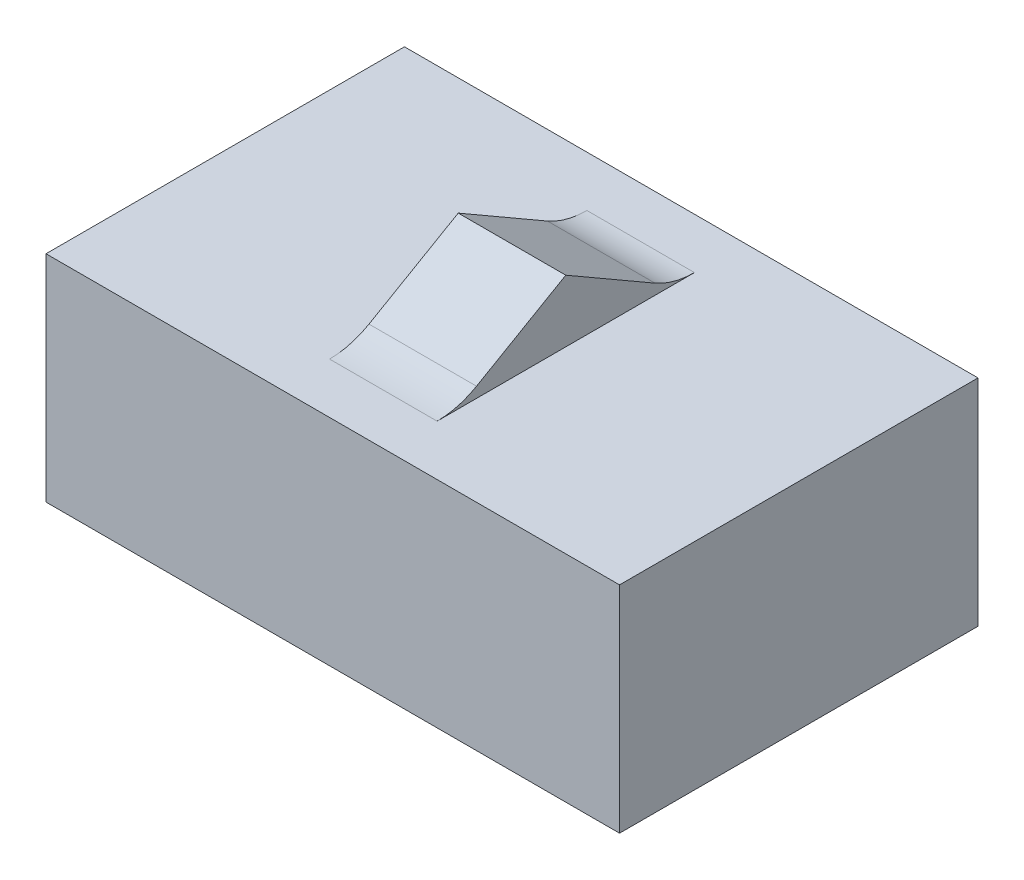
ISO-10303-21;
HEADER;
FILE_DESCRIPTION(('STEP AP214'),'2;1');
FILE_NAME('part.step','',(''),(''),'','','');
FILE_SCHEMA(('AUTOMOTIVE_DESIGN { 1 0 10303 214 1 1 1 1 }'));
ENDSEC;
DATA;
#1=APPLICATION_CONTEXT('core data for automotive mechanical design processes');
#2=APPLICATION_PROTOCOL_DEFINITION('international standard','automotive_design',2000,#1);
#3=PRODUCT_CONTEXT('',#1,'mechanical');
#4=PRODUCT('Part','Part','',(#3));
#5=PRODUCT_RELATED_PRODUCT_CATEGORY('part','',(#4));
#6=PRODUCT_DEFINITION_FORMATION('','',#4);
#7=PRODUCT_DEFINITION_CONTEXT('part definition',#1,'design');
#8=PRODUCT_DEFINITION('design','',#6,#7);
#9=PRODUCT_DEFINITION_SHAPE('','',#8);
#10=(LENGTH_UNIT() NAMED_UNIT(*) SI_UNIT(.MILLI.,.METRE.));
#11=(NAMED_UNIT(*) PLANE_ANGLE_UNIT() SI_UNIT($,.RADIAN.));
#12=(NAMED_UNIT(*) SI_UNIT($,.STERADIAN.) SOLID_ANGLE_UNIT());
#13=UNCERTAINTY_MEASURE_WITH_UNIT(LENGTH_MEASURE(1.E-05),#10,'distance_accuracy_value','');
#14=(GEOMETRIC_REPRESENTATION_CONTEXT(3) GLOBAL_UNCERTAINTY_ASSIGNED_CONTEXT((#13)) GLOBAL_UNIT_ASSIGNED_CONTEXT((#10,
#11,#12)) REPRESENTATION_CONTEXT('',''));
#15=CARTESIAN_POINT('',(0.,0.,0.));
#16=DIRECTION('',(0.,0.,1.));
#17=DIRECTION('',(1.,0.,0.));
#18=AXIS2_PLACEMENT_3D('',#15,#16,#17);
#19=CARTESIAN_POINT('',(-4.,3.,-2.5));
#20=DIRECTION('',(1.,0.,0.));
#21=DIRECTION('',(0.,0.,-1.));
#22=AXIS2_PLACEMENT_3D('',#19,#20,#21);
#23=PLANE('',#22);
#24=DIRECTION('',(0.,0.,1.));
#25=VECTOR('',#24,1.);
#26=CARTESIAN_POINT('',(-4.,0.,-2.5));
#27=LINE('',#26,#25);
#28=CARTESIAN_POINT('',(-4.,0.,-2.5));
#29=VERTEX_POINT('',#28);
#30=CARTESIAN_POINT('',(-4.,0.,2.5));
#31=VERTEX_POINT('',#30);
#32=EDGE_CURVE('E130',#29,#31,#27,.T.);
#33=ORIENTED_EDGE('',*,*,#32,.T.);
#34=DIRECTION('',(0.,-1.,0.));
#35=VECTOR('',#34,1.);
#36=CARTESIAN_POINT('',(-4.,3.,2.5));
#37=LINE('',#36,#35);
#38=CARTESIAN_POINT('',(-4.,3.,2.5));
#39=VERTEX_POINT('',#38);
#40=EDGE_CURVE('E162',#39,#31,#37,.T.);
#41=ORIENTED_EDGE('',*,*,#40,.F.);
#42=DIRECTION('',(0.,0.,1.));
#43=VECTOR('',#42,1.);
#44=CARTESIAN_POINT('',(-4.,3.,-2.5));
#45=LINE('',#44,#43);
#46=CARTESIAN_POINT('',(-4.,3.,-2.5));
#47=VERTEX_POINT('',#46);
#48=EDGE_CURVE('E139',#47,#39,#45,.T.);
#49=ORIENTED_EDGE('',*,*,#48,.F.);
#50=DIRECTION('',(0.,-1.,0.));
#51=VECTOR('',#50,1.);
#52=CARTESIAN_POINT('',(-4.,3.,-2.5));
#53=LINE('',#52,#51);
#54=EDGE_CURVE('E148',#47,#29,#53,.T.);
#55=ORIENTED_EDGE('',*,*,#54,.T.);
#56=EDGE_LOOP('',(#33,#41,#49,#55));
#57=FACE_BOUND('',#56,.T.);
#58=ADVANCED_FACE('F39',(#57),#23,.F.);
#59=CARTESIAN_POINT('',(4.,3.,2.5));
#60=DIRECTION('',(0.,0.,-1.));
#61=DIRECTION('',(-1.,0.,0.));
#62=AXIS2_PLACEMENT_3D('',#59,#60,#61);
#63=PLANE('',#62);
#64=DIRECTION('',(1.,0.,0.));
#65=VECTOR('',#64,1.);
#66=CARTESIAN_POINT('',(4.,0.,2.5));
#67=LINE('',#66,#65);
#68=CARTESIAN_POINT('',(4.,0.,2.5));
#69=VERTEX_POINT('',#68);
#70=EDGE_CURVE('E133',#31,#69,#67,.T.);
#71=ORIENTED_EDGE('',*,*,#70,.T.);
#72=DIRECTION('',(0.,-1.,0.));
#73=VECTOR('',#72,1.);
#74=CARTESIAN_POINT('',(4.,3.,2.5));
#75=LINE('',#74,#73);
#76=CARTESIAN_POINT('',(4.,3.,2.5));
#77=VERTEX_POINT('',#76);
#78=EDGE_CURVE('E159',#77,#69,#75,.T.);
#79=ORIENTED_EDGE('',*,*,#78,.F.);
#80=DIRECTION('',(1.,0.,0.));
#81=VECTOR('',#80,1.);
#82=CARTESIAN_POINT('',(4.,3.,2.5));
#83=LINE('',#82,#81);
#84=EDGE_CURVE('E142',#39,#77,#83,.T.);
#85=ORIENTED_EDGE('',*,*,#84,.F.);
#86=ORIENTED_EDGE('',*,*,#40,.T.);
#87=EDGE_LOOP('',(#71,#79,#85,#86));
#88=FACE_BOUND('',#87,.T.);
#89=ADVANCED_FACE('F193',(#88),#63,.F.);
#90=CARTESIAN_POINT('',(4.,3.,-2.5));
#91=DIRECTION('',(-1.,0.,0.));
#92=DIRECTION('',(0.,0.,1.));
#93=AXIS2_PLACEMENT_3D('',#90,#91,#92);
#94=PLANE('',#93);
#95=DIRECTION('',(0.,0.,-1.));
#96=VECTOR('',#95,1.);
#97=CARTESIAN_POINT('',(4.,0.,-2.5));
#98=LINE('',#97,#96);
#99=CARTESIAN_POINT('',(4.,0.,-2.5));
#100=VERTEX_POINT('',#99);
#101=EDGE_CURVE('E151',#69,#100,#98,.T.);
#102=ORIENTED_EDGE('',*,*,#101,.T.);
#103=DIRECTION('',(0.,-1.,0.));
#104=VECTOR('',#103,1.);
#105=CARTESIAN_POINT('',(4.,3.,-2.5));
#106=LINE('',#105,#104);
#107=CARTESIAN_POINT('',(4.,3.,-2.5));
#108=VERTEX_POINT('',#107);
#109=EDGE_CURVE('E156',#108,#100,#106,.T.);
#110=ORIENTED_EDGE('',*,*,#109,.F.);
#111=DIRECTION('',(0.,0.,-1.));
#112=VECTOR('',#111,1.);
#113=CARTESIAN_POINT('',(4.,3.,-2.5));
#114=LINE('',#113,#112);
#115=EDGE_CURVE('E145',#77,#108,#114,.T.);
#116=ORIENTED_EDGE('',*,*,#115,.F.);
#117=ORIENTED_EDGE('',*,*,#78,.T.);
#118=EDGE_LOOP('',(#102,#110,#116,#117));
#119=FACE_BOUND('',#118,.T.);
#120=ADVANCED_FACE('F199',(#119),#94,.F.);
#121=CARTESIAN_POINT('',(4.,3.,-2.5));
#122=DIRECTION('',(0.,0.,1.));
#123=DIRECTION('',(1.,0.,0.));
#124=AXIS2_PLACEMENT_3D('',#121,#122,#123);
#125=PLANE('',#124);
#126=DIRECTION('',(-1.,0.,0.));
#127=VECTOR('',#126,1.);
#128=CARTESIAN_POINT('',(4.,0.,-2.5));
#129=LINE('',#128,#127);
#130=EDGE_CURVE('E143',#100,#29,#129,.T.);
#131=ORIENTED_EDGE('',*,*,#130,.T.);
#132=ORIENTED_EDGE('',*,*,#54,.F.);
#133=DIRECTION('',(-1.,0.,0.));
#134=VECTOR('',#133,1.);
#135=CARTESIAN_POINT('',(4.,3.,-2.5));
#136=LINE('',#135,#134);
#137=EDGE_CURVE('E147',#108,#47,#136,.T.);
#138=ORIENTED_EDGE('',*,*,#137,.F.);
#139=ORIENTED_EDGE('',*,*,#109,.T.);
#140=EDGE_LOOP('',(#131,#132,#138,#139));
#141=FACE_BOUND('',#140,.T.);
#142=ADVANCED_FACE('F205',(#141),#125,.F.);
#143=CARTESIAN_POINT('',(0.,3.,0.));
#144=DIRECTION('',(0.,-1.,0.));
#145=DIRECTION('',(0.,0.,-1.));
#146=AXIS2_PLACEMENT_3D('',#143,#144,#145);
#147=PLANE('',#146);
#148=DIRECTION('',(0.,0.,-1.));
#149=VECTOR('',#148,1.);
#150=CARTESIAN_POINT('',(-0.75,3.,1.5));
#151=LINE('',#150,#149);
#152=CARTESIAN_POINT('',(-0.75,3.,1.79474411167423));
#153=VERTEX_POINT('',#152);
#154=CARTESIAN_POINT('',(-0.75,3.,-1.79474411167423));
#155=VERTEX_POINT('',#154);
#156=EDGE_CURVE('E120',#153,#155,#151,.T.);
#157=ORIENTED_EDGE('',*,*,#156,.T.);
#158=DIRECTION('',(-1.,0.,0.));
#159=VECTOR('',#158,1.);
#160=CARTESIAN_POINT('',(0.75,3.,-1.79474411167423));
#161=LINE('',#160,#159);
#162=CARTESIAN_POINT('',(0.75,3.,-1.79474411167423));
#163=VERTEX_POINT('',#162);
#164=EDGE_CURVE('E170',#155,#163,#161,.F.);
#165=ORIENTED_EDGE('',*,*,#164,.T.);
#166=DIRECTION('',(0.,0.,-1.));
#167=VECTOR('',#166,1.);
#168=CARTESIAN_POINT('',(0.75,3.,1.5));
#169=LINE('',#168,#167);
#170=CARTESIAN_POINT('',(0.75,3.,1.79474411167423));
#171=VERTEX_POINT('',#170);
#172=EDGE_CURVE('E125',#171,#163,#169,.T.);
#173=ORIENTED_EDGE('',*,*,#172,.F.);
#174=DIRECTION('',(-1.,0.,0.));
#175=VECTOR('',#174,1.);
#176=CARTESIAN_POINT('',(-0.75,3.,1.79474411167423));
#177=LINE('',#176,#175);
#178=EDGE_CURVE('E167',#171,#153,#177,.T.);
#179=ORIENTED_EDGE('',*,*,#178,.T.);
#180=EDGE_LOOP('',(#157,#165,#173,#179));
#181=FACE_BOUND('',#180,.T.);
#182=ORIENTED_EDGE('',*,*,#48,.T.);
#183=ORIENTED_EDGE('',*,*,#84,.T.);
#184=ORIENTED_EDGE('',*,*,#115,.T.);
#185=ORIENTED_EDGE('',*,*,#137,.T.);
#186=EDGE_LOOP('',(#182,#183,#184,#185));
#187=FACE_BOUND('',#186,.T.);
#188=ADVANCED_FACE('F182',(#181,#187),#147,.F.);
#189=CARTESIAN_POINT('',(0.,0.,0.));
#190=DIRECTION('',(0.,-1.,0.));
#191=DIRECTION('',(0.,0.,-1.));
#192=AXIS2_PLACEMENT_3D('',#189,#190,#191);
#193=PLANE('',#192);
#194=ORIENTED_EDGE('',*,*,#32,.F.);
#195=ORIENTED_EDGE('',*,*,#130,.F.);
#196=ORIENTED_EDGE('',*,*,#101,.F.);
#197=ORIENTED_EDGE('',*,*,#70,.F.);
#198=EDGE_LOOP('',(#194,#195,#196,#197));
#199=FACE_BOUND('',#198,.T.);
#200=ADVANCED_FACE('F210',(#199),#193,.T.);
#201=CARTESIAN_POINT('',(0.75,3.86602540378443,0.));
#202=DIRECTION('',(0.,-0.866025403784441,0.499999999999995));
#203=DIRECTION('',(0.,-0.499999999999995,-0.866025403784442));
#204=AXIS2_PLACEMENT_3D('',#201,#202,#203);
#205=PLANE('',#204);
#206=DIRECTION('',(0.,0.499999999999995,0.866025403784442));
#207=VECTOR('',#206,1.);
#208=CARTESIAN_POINT('',(0.75,3.86602540378443,0.));
#209=LINE('',#208,#207);
#210=CARTESIAN_POINT('',(0.75,3.14737205583711,-1.24474411167424));
#211=VERTEX_POINT('',#210);
#212=CARTESIAN_POINT('',(0.75,3.86602540378443,0.));
#213=VERTEX_POINT('',#212);
#214=EDGE_CURVE('E110',#211,#213,#209,.T.);
#215=ORIENTED_EDGE('',*,*,#214,.F.);
#216=DIRECTION('',(-1.,0.,0.));
#217=VECTOR('',#216,1.);
#218=CARTESIAN_POINT('',(-0.75,3.14737205583711,-1.24474411167424));
#219=LINE('',#218,#217);
#220=CARTESIAN_POINT('',(-0.75,3.14737205583711,-1.24474411167424));
#221=VERTEX_POINT('',#220);
#222=EDGE_CURVE('E165',#211,#221,#219,.T.);
#223=ORIENTED_EDGE('',*,*,#222,.T.);
#224=DIRECTION('',(0.,0.499999999999995,0.866025403784442));
#225=VECTOR('',#224,1.);
#226=CARTESIAN_POINT('',(-0.75,3.86602540378443,0.));
#227=LINE('',#226,#225);
#228=CARTESIAN_POINT('',(-0.75,3.86602540378443,0.));
#229=VERTEX_POINT('',#228);
#230=EDGE_CURVE('E129',#221,#229,#227,.T.);
#231=ORIENTED_EDGE('',*,*,#230,.T.);
#232=DIRECTION('',(-1.,0.,0.));
#233=VECTOR('',#232,1.);
#234=CARTESIAN_POINT('',(0.75,3.86602540378443,0.));
#235=LINE('',#234,#233);
#236=EDGE_CURVE('E124',#213,#229,#235,.T.);
#237=ORIENTED_EDGE('',*,*,#236,.F.);
#238=EDGE_LOOP('',(#215,#223,#231,#237));
#239=FACE_BOUND('',#238,.T.);
#240=ADVANCED_FACE('F127',(#239),#205,.F.);
#241=CARTESIAN_POINT('',(0.75,3.86602540378443,0.));
#242=DIRECTION('',(0.,-0.866025403784441,-0.499999999999995));
#243=DIRECTION('',(0.,0.499999999999995,-0.866025403784442));
#244=AXIS2_PLACEMENT_3D('',#241,#242,#243);
#245=PLANE('',#244);
#246=DIRECTION('',(0.,-0.499999999999995,0.866025403784442));
#247=VECTOR('',#246,1.);
#248=CARTESIAN_POINT('',(-0.75,3.86602540378443,0.));
#249=LINE('',#248,#247);
#250=CARTESIAN_POINT('',(-0.75,3.14737205583711,1.24474411167424));
#251=VERTEX_POINT('',#250);
#252=EDGE_CURVE('E185',#229,#251,#249,.T.);
#253=ORIENTED_EDGE('',*,*,#252,.T.);
#254=DIRECTION('',(-1.,0.,0.));
#255=VECTOR('',#254,1.);
#256=CARTESIAN_POINT('',(0.75,3.14737205583711,1.24474411167424));
#257=LINE('',#256,#255);
#258=CARTESIAN_POINT('',(0.75,3.14737205583711,1.24474411167424));
#259=VERTEX_POINT('',#258);
#260=EDGE_CURVE('E54',#251,#259,#257,.F.);
#261=ORIENTED_EDGE('',*,*,#260,.T.);
#262=DIRECTION('',(0.,-0.499999999999995,0.866025403784442));
#263=VECTOR('',#262,1.);
#264=CARTESIAN_POINT('',(0.75,3.86602540378443,0.));
#265=LINE('',#264,#263);
#266=EDGE_CURVE('E112',#213,#259,#265,.T.);
#267=ORIENTED_EDGE('',*,*,#266,.F.);
#268=ORIENTED_EDGE('',*,*,#236,.T.);
#269=EDGE_LOOP('',(#253,#261,#267,#268));
#270=FACE_BOUND('',#269,.T.);
#271=ADVANCED_FACE('F123',(#270),#245,.F.);
#272=CARTESIAN_POINT('',(0.75,0.,0.));
#273=DIRECTION('',(-1.,0.,0.));
#274=DIRECTION('',(0.,0.,1.));
#275=AXIS2_PLACEMENT_3D('',#272,#273,#274);
#276=PLANE('',#275);
#277=ORIENTED_EDGE('',*,*,#172,.T.);
#278=CARTESIAN_POINT('',(0.75,4.1,-1.79474411167423));
#279=DIRECTION('',(-1.,0.,0.));
#280=DIRECTION('',(0.,0.,1.));
#281=AXIS2_PLACEMENT_3D('',#278,#279,#280);
#282=CIRCLE('',#281,1.1);
#283=EDGE_CURVE('E115',#163,#211,#282,.T.);
#284=ORIENTED_EDGE('',*,*,#283,.T.);
#285=ORIENTED_EDGE('',*,*,#214,.T.);
#286=ORIENTED_EDGE('',*,*,#266,.T.);
#287=CARTESIAN_POINT('',(0.75,4.1,1.79474411167423));
#288=DIRECTION('',(-1.,0.,0.));
#289=DIRECTION('',(0.,0.,1.));
#290=AXIS2_PLACEMENT_3D('',#287,#288,#289);
#291=CIRCLE('',#290,1.1);
#292=EDGE_CURVE('E13',#259,#171,#291,.T.);
#293=ORIENTED_EDGE('',*,*,#292,.T.);
#294=EDGE_LOOP('',(#277,#284,#285,#286,#293));
#295=FACE_BOUND('',#294,.T.);
#296=ADVANCED_FACE('F111',(#295),#276,.F.);
#297=CARTESIAN_POINT('',(-0.75,0.,0.));
#298=DIRECTION('',(-1.,0.,0.));
#299=DIRECTION('',(0.,0.,1.));
#300=AXIS2_PLACEMENT_3D('',#297,#298,#299);
#301=PLANE('',#300);
#302=ORIENTED_EDGE('',*,*,#230,.F.);
#303=CARTESIAN_POINT('',(-0.75,4.1,-1.79474411167423));
#304=DIRECTION('',(-1.,0.,0.));
#305=DIRECTION('',(0.,0.,1.));
#306=AXIS2_PLACEMENT_3D('',#303,#304,#305);
#307=CIRCLE('',#306,1.1);
#308=EDGE_CURVE('E174',#221,#155,#307,.F.);
#309=ORIENTED_EDGE('',*,*,#308,.T.);
#310=ORIENTED_EDGE('',*,*,#156,.F.);
#311=CARTESIAN_POINT('',(-0.75,4.1,1.79474411167423));
#312=DIRECTION('',(-1.,0.,0.));
#313=DIRECTION('',(0.,0.,1.));
#314=AXIS2_PLACEMENT_3D('',#311,#312,#313);
#315=CIRCLE('',#314,1.1);
#316=EDGE_CURVE('E47',#153,#251,#315,.F.);
#317=ORIENTED_EDGE('',*,*,#316,.T.);
#318=ORIENTED_EDGE('',*,*,#252,.F.);
#319=EDGE_LOOP('',(#302,#309,#310,#317,#318));
#320=FACE_BOUND('',#319,.T.);
#321=ADVANCED_FACE('F178',(#320),#301,.T.);
#322=CARTESIAN_POINT('',(0.75,4.1,-1.79474411167423));
#323=DIRECTION('',(1.,0.,0.));
#324=DIRECTION('',(0.,0.,-1.));
#325=AXIS2_PLACEMENT_3D('',#322,#323,#324);
#326=CYLINDRICAL_SURFACE('',#325,1.1);
#327=ORIENTED_EDGE('',*,*,#283,.F.);
#328=ORIENTED_EDGE('',*,*,#164,.F.);
#329=ORIENTED_EDGE('',*,*,#308,.F.);
#330=ORIENTED_EDGE('',*,*,#222,.F.);
#331=EDGE_LOOP('',(#327,#328,#329,#330));
#332=FACE_BOUND('',#331,.T.);
#333=ADVANCED_FACE('F180',(#332),#326,.F.);
#334=CARTESIAN_POINT('',(0.,4.1,1.79474411167423));
#335=DIRECTION('',(1.,0.,0.));
#336=DIRECTION('',(0.,0.,-1.));
#337=AXIS2_PLACEMENT_3D('',#334,#335,#336);
#338=CYLINDRICAL_SURFACE('',#337,1.1);
#339=ORIENTED_EDGE('',*,*,#292,.F.);
#340=ORIENTED_EDGE('',*,*,#260,.F.);
#341=ORIENTED_EDGE('',*,*,#316,.F.);
#342=ORIENTED_EDGE('',*,*,#178,.F.);
#343=EDGE_LOOP('',(#339,#340,#341,#342));
#344=FACE_BOUND('',#343,.T.);
#345=ADVANCED_FACE('F41',(#344),#338,.F.);
#346=CLOSED_SHELL('',(#58,#89,#120,#142,#188,#200,#240,#271,#296,#321,#333,#345));
#347=MANIFOLD_SOLID_BREP('B2',#346);
#348=ADVANCED_BREP_SHAPE_REPRESENTATION('',(#18,#347),#14);
#349=SHAPE_DEFINITION_REPRESENTATION(#9,#348);
ENDSEC;
END-ISO-10303-21;
